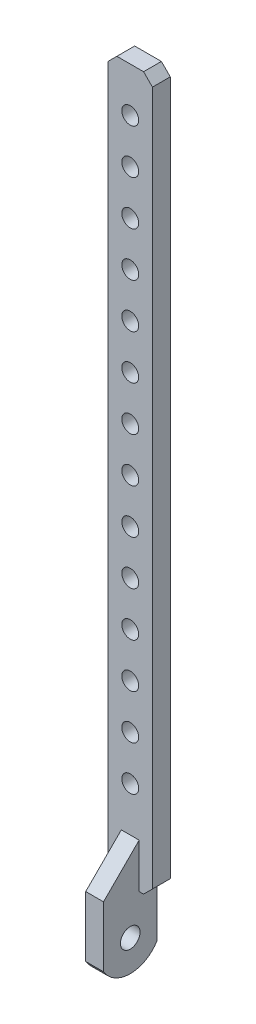
ISO-10303-21;
HEADER;
FILE_DESCRIPTION(('STEP AP214'),'2;1');
FILE_NAME('part.step','',(''),(''),'','','');
FILE_SCHEMA(('AUTOMOTIVE_DESIGN { 1 0 10303 214 1 1 1 1 }'));
ENDSEC;
DATA;
#1=APPLICATION_CONTEXT('core data for automotive mechanical design processes');
#2=APPLICATION_PROTOCOL_DEFINITION('international standard','automotive_design',2000,#1);
#3=PRODUCT_CONTEXT('',#1,'mechanical');
#4=PRODUCT('Part','Part','',(#3));
#5=PRODUCT_RELATED_PRODUCT_CATEGORY('part','',(#4));
#6=PRODUCT_DEFINITION_FORMATION('','',#4);
#7=PRODUCT_DEFINITION_CONTEXT('part definition',#1,'design');
#8=PRODUCT_DEFINITION('design','',#6,#7);
#9=PRODUCT_DEFINITION_SHAPE('','',#8);
#10=(LENGTH_UNIT() NAMED_UNIT(*) SI_UNIT(.MILLI.,.METRE.));
#11=(NAMED_UNIT(*) PLANE_ANGLE_UNIT() SI_UNIT($,.RADIAN.));
#12=(NAMED_UNIT(*) SI_UNIT($,.STERADIAN.) SOLID_ANGLE_UNIT());
#13=UNCERTAINTY_MEASURE_WITH_UNIT(LENGTH_MEASURE(1.E-05),#10,'distance_accuracy_value','');
#14=(GEOMETRIC_REPRESENTATION_CONTEXT(3) GLOBAL_UNCERTAINTY_ASSIGNED_CONTEXT((#13)) GLOBAL_UNIT_ASSIGNED_CONTEXT((#10,
#11,#12)) REPRESENTATION_CONTEXT('',''));
#15=CARTESIAN_POINT('',(0.,0.,0.));
#16=DIRECTION('',(0.,0.,1.));
#17=DIRECTION('',(1.,0.,0.));
#18=AXIS2_PLACEMENT_3D('',#15,#16,#17);
#19=CARTESIAN_POINT('',(-2.5,-40.,2.));
#20=DIRECTION('',(0.,1.,0.));
#21=DIRECTION('',(0.,0.,1.));
#22=AXIS2_PLACEMENT_3D('',#19,#20,#21);
#23=PLANE('',#22);
#24=DIRECTION('',(1.,0.,0.));
#25=VECTOR('',#24,1.);
#26=CARTESIAN_POINT('',(-2.5,-40.,2.));
#27=LINE('',#26,#25);
#28=CARTESIAN_POINT('',(-1.50000000000001,-40.,2.));
#29=VERTEX_POINT('',#28);
#30=CARTESIAN_POINT('',(-1.,-40.,2.));
#31=VERTEX_POINT('',#30);
#32=EDGE_CURVE('E211',#29,#31,#27,.T.);
#33=ORIENTED_EDGE('',*,*,#32,.F.);
#34=DIRECTION('',(0.,0.,-1.));
#35=VECTOR('',#34,1.);
#36=CARTESIAN_POINT('',(-1.50000000000001,-40.,2.));
#37=LINE('',#36,#35);
#38=CARTESIAN_POINT('',(-1.50000000000002,-40.,0.));
#39=VERTEX_POINT('',#38);
#40=EDGE_CURVE('E40',#29,#39,#37,.T.);
#41=ORIENTED_EDGE('',*,*,#40,.T.);
#42=DIRECTION('',(1.,0.,0.));
#43=VECTOR('',#42,1.);
#44=CARTESIAN_POINT('',(-2.5,-40.,0.));
#45=LINE('',#44,#43);
#46=CARTESIAN_POINT('',(-1.,-40.,0.));
#47=VERTEX_POINT('',#46);
#48=EDGE_CURVE('E198',#39,#47,#45,.T.);
#49=ORIENTED_EDGE('',*,*,#48,.T.);
#50=DIRECTION('',(0.,0.,-1.));
#51=VECTOR('',#50,1.);
#52=CARTESIAN_POINT('',(-1.,-40.,6.));
#53=LINE('',#52,#51);
#54=EDGE_CURVE('E170',#31,#47,#53,.T.);
#55=ORIENTED_EDGE('',*,*,#54,.F.);
#56=EDGE_LOOP('',(#33,#41,#49,#55));
#57=FACE_BOUND('',#56,.T.);
#58=ADVANCED_FACE('F32',(#57),#23,.F.);
#59=CARTESIAN_POINT('',(2.5,-40.,2.));
#60=DIRECTION('',(-1.,0.,0.));
#61=DIRECTION('',(0.,0.,1.));
#62=AXIS2_PLACEMENT_3D('',#59,#60,#61);
#63=PLANE('',#62);
#64=DIRECTION('',(0.,1.,0.));
#65=VECTOR('',#64,1.);
#66=CARTESIAN_POINT('',(2.5,-40.,0.));
#67=LINE('',#66,#65);
#68=CARTESIAN_POINT('',(2.5,-39.,0.));
#69=VERTEX_POINT('',#68);
#70=CARTESIAN_POINT('',(2.5,39.,0.));
#71=VERTEX_POINT('',#70);
#72=EDGE_CURVE('E298',#69,#71,#67,.T.);
#73=ORIENTED_EDGE('',*,*,#72,.T.);
#74=DIRECTION('',(0.,0.,1.));
#75=VECTOR('',#74,1.);
#76=CARTESIAN_POINT('',(2.5,39.,2.));
#77=LINE('',#76,#75);
#78=CARTESIAN_POINT('',(2.50000000000001,39.,2.));
#79=VERTEX_POINT('',#78);
#80=EDGE_CURVE('E55',#71,#79,#77,.T.);
#81=ORIENTED_EDGE('',*,*,#80,.T.);
#82=DIRECTION('',(0.,1.,0.));
#83=VECTOR('',#82,1.);
#84=CARTESIAN_POINT('',(2.5,-40.,2.));
#85=LINE('',#84,#83);
#86=CARTESIAN_POINT('',(2.5,-39.,2.));
#87=VERTEX_POINT('',#86);
#88=EDGE_CURVE('E201',#87,#79,#85,.T.);
#89=ORIENTED_EDGE('',*,*,#88,.F.);
#90=DIRECTION('',(0.,0.,-1.));
#91=VECTOR('',#90,1.);
#92=CARTESIAN_POINT('',(2.5,-39.,2.));
#93=LINE('',#92,#91);
#94=EDGE_CURVE('E336',#87,#69,#93,.T.);
#95=ORIENTED_EDGE('',*,*,#94,.T.);
#96=EDGE_LOOP('',(#73,#81,#89,#95));
#97=FACE_BOUND('',#96,.T.);
#98=ADVANCED_FACE('F361',(#97),#63,.F.);
#99=CARTESIAN_POINT('',(-2.5,40.,2.));
#100=DIRECTION('',(0.,-1.,0.));
#101=DIRECTION('',(0.,0.,-1.));
#102=AXIS2_PLACEMENT_3D('',#99,#100,#101);
#103=PLANE('',#102);
#104=DIRECTION('',(-1.,0.,0.));
#105=VECTOR('',#104,1.);
#106=CARTESIAN_POINT('',(-2.5,40.,0.));
#107=LINE('',#106,#105);
#108=CARTESIAN_POINT('',(1.50000000000002,40.,0.));
#109=VERTEX_POINT('',#108);
#110=CARTESIAN_POINT('',(-1.49999999999998,40.,0.));
#111=VERTEX_POINT('',#110);
#112=EDGE_CURVE('E309',#109,#111,#107,.T.);
#113=ORIENTED_EDGE('',*,*,#112,.T.);
#114=DIRECTION('',(0.,0.,1.));
#115=VECTOR('',#114,1.);
#116=CARTESIAN_POINT('',(-1.49999999999998,40.,2.));
#117=LINE('',#116,#115);
#118=CARTESIAN_POINT('',(-1.49999999999998,40.,2.));
#119=VERTEX_POINT('',#118);
#120=EDGE_CURVE('E331',#111,#119,#117,.T.);
#121=ORIENTED_EDGE('',*,*,#120,.T.);
#122=DIRECTION('',(-1.,0.,0.));
#123=VECTOR('',#122,1.);
#124=CARTESIAN_POINT('',(-2.5,40.,2.));
#125=LINE('',#124,#123);
#126=CARTESIAN_POINT('',(1.50000000000001,40.,2.));
#127=VERTEX_POINT('',#126);
#128=EDGE_CURVE('E302',#127,#119,#125,.T.);
#129=ORIENTED_EDGE('',*,*,#128,.F.);
#130=DIRECTION('',(0.,0.,-1.));
#131=VECTOR('',#130,1.);
#132=CARTESIAN_POINT('',(1.50000000000001,40.,2.));
#133=LINE('',#132,#131);
#134=EDGE_CURVE('E367',#127,#109,#133,.T.);
#135=ORIENTED_EDGE('',*,*,#134,.T.);
#136=EDGE_LOOP('',(#113,#121,#129,#135));
#137=FACE_BOUND('',#136,.T.);
#138=ADVANCED_FACE('F371',(#137),#103,.F.);
#139=CARTESIAN_POINT('',(-2.5,-40.,2.));
#140=DIRECTION('',(1.,0.,0.));
#141=DIRECTION('',(0.,0.,-1.));
#142=AXIS2_PLACEMENT_3D('',#139,#140,#141);
#143=PLANE('',#142);
#144=DIRECTION('',(0.,-1.,0.));
#145=VECTOR('',#144,1.);
#146=CARTESIAN_POINT('',(-2.5,-40.,2.));
#147=LINE('',#146,#145);
#148=CARTESIAN_POINT('',(-2.50000000000001,39.,2.));
#149=VERTEX_POINT('',#148);
#150=CARTESIAN_POINT('',(-2.5,-39.,2.));
#151=VERTEX_POINT('',#150);
#152=EDGE_CURVE('E305',#149,#151,#147,.T.);
#153=ORIENTED_EDGE('',*,*,#152,.F.);
#154=DIRECTION('',(0.,0.,-1.));
#155=VECTOR('',#154,1.);
#156=CARTESIAN_POINT('',(-2.5,39.,2.));
#157=LINE('',#156,#155);
#158=CARTESIAN_POINT('',(-2.5,39.,0.));
#159=VERTEX_POINT('',#158);
#160=EDGE_CURVE('E194',#149,#159,#157,.T.);
#161=ORIENTED_EDGE('',*,*,#160,.T.);
#162=DIRECTION('',(0.,-1.,0.));
#163=VECTOR('',#162,1.);
#164=CARTESIAN_POINT('',(-2.5,-40.,0.));
#165=LINE('',#164,#163);
#166=CARTESIAN_POINT('',(-2.5,-39.,0.));
#167=VERTEX_POINT('',#166);
#168=EDGE_CURVE('E206',#159,#167,#165,.T.);
#169=ORIENTED_EDGE('',*,*,#168,.T.);
#170=DIRECTION('',(0.,0.,1.));
#171=VECTOR('',#170,1.);
#172=CARTESIAN_POINT('',(-2.5,-39.,2.));
#173=LINE('',#172,#171);
#174=EDGE_CURVE('E192',#167,#151,#173,.T.);
#175=ORIENTED_EDGE('',*,*,#174,.T.);
#176=EDGE_LOOP('',(#153,#161,#169,#175));
#177=FACE_BOUND('',#176,.T.);
#178=ADVANCED_FACE('F319',(#177),#143,.F.);
#179=CARTESIAN_POINT('',(1.,-40.,0.));
#180=VERTEX_POINT('',#179);
#181=CARTESIAN_POINT('',(1.49999999999999,-40.,0.));
#182=VERTEX_POINT('',#181);
#183=EDGE_CURVE('E163',#180,#182,#45,.T.);
#184=ORIENTED_EDGE('',*,*,#183,.T.);
#185=DIRECTION('',(0.,0.,1.));
#186=VECTOR('',#185,1.);
#187=CARTESIAN_POINT('',(1.49999999999999,-40.,2.));
#188=LINE('',#187,#186);
#189=CARTESIAN_POINT('',(1.49999999999998,-40.,2.));
#190=VERTEX_POINT('',#189);
#191=EDGE_CURVE('E11',#182,#190,#188,.T.);
#192=ORIENTED_EDGE('',*,*,#191,.T.);
#193=CARTESIAN_POINT('',(1.,-40.,2.));
#194=VERTEX_POINT('',#193);
#195=EDGE_CURVE('E307',#194,#190,#27,.T.);
#196=ORIENTED_EDGE('',*,*,#195,.F.);
#197=DIRECTION('',(0.,0.,-1.));
#198=VECTOR('',#197,1.);
#199=CARTESIAN_POINT('',(1.,-40.,6.));
#200=LINE('',#199,#198);
#201=EDGE_CURVE('E209',#194,#180,#200,.T.);
#202=ORIENTED_EDGE('',*,*,#201,.T.);
#203=EDGE_LOOP('',(#184,#192,#196,#202));
#204=FACE_BOUND('',#203,.T.);
#205=ADVANCED_FACE('F388',(#204),#23,.F.);
#206=CARTESIAN_POINT('',(0.,0.,2.));
#207=DIRECTION('',(0.,0.,-1.));
#208=DIRECTION('',(-1.,0.,0.));
#209=AXIS2_PLACEMENT_3D('',#206,#207,#208);
#210=PLANE('',#209);
#211=CARTESIAN_POINT('',(0.,-30.,2.));
#212=DIRECTION('',(0.,0.,1.));
#213=DIRECTION('',(1.,0.,0.));
#214=AXIS2_PLACEMENT_3D('',#211,#212,#213);
#215=CIRCLE('',#214,0.95);
#216=CARTESIAN_POINT('',(0.95,-30.,2.));
#217=VERTEX_POINT('',#216);
#218=EDGE_CURVE('E220',#217,#217,#215,.T.);
#219=ORIENTED_EDGE('',*,*,#218,.F.);
#220=EDGE_LOOP('',(#219));
#221=FACE_BOUND('',#220,.T.);
#222=CARTESIAN_POINT('',(0.,-25.,2.));
#223=DIRECTION('',(0.,0.,1.));
#224=DIRECTION('',(1.,0.,0.));
#225=AXIS2_PLACEMENT_3D('',#222,#223,#224);
#226=CIRCLE('',#225,0.95);
#227=CARTESIAN_POINT('',(0.95,-25.,2.));
#228=VERTEX_POINT('',#227);
#229=EDGE_CURVE('E219',#228,#228,#226,.T.);
#230=ORIENTED_EDGE('',*,*,#229,.F.);
#231=EDGE_LOOP('',(#230));
#232=FACE_BOUND('',#231,.T.);
#233=CARTESIAN_POINT('',(0.,-20.,2.));
#234=DIRECTION('',(0.,0.,1.));
#235=DIRECTION('',(1.,0.,0.));
#236=AXIS2_PLACEMENT_3D('',#233,#234,#235);
#237=CIRCLE('',#236,0.95);
#238=CARTESIAN_POINT('',(0.950000000000006,-20.,2.));
#239=VERTEX_POINT('',#238);
#240=EDGE_CURVE('E226',#239,#239,#237,.T.);
#241=ORIENTED_EDGE('',*,*,#240,.F.);
#242=EDGE_LOOP('',(#241));
#243=FACE_BOUND('',#242,.T.);
#244=CARTESIAN_POINT('',(0.,-15.,2.));
#245=DIRECTION('',(0.,0.,1.));
#246=DIRECTION('',(1.,0.,0.));
#247=AXIS2_PLACEMENT_3D('',#244,#245,#246);
#248=CIRCLE('',#247,0.95);
#249=CARTESIAN_POINT('',(0.950000000000006,-15.,2.));
#250=VERTEX_POINT('',#249);
#251=EDGE_CURVE('E232',#250,#250,#248,.T.);
#252=ORIENTED_EDGE('',*,*,#251,.F.);
#253=EDGE_LOOP('',(#252));
#254=FACE_BOUND('',#253,.T.);
#255=CARTESIAN_POINT('',(0.,-9.99999999999999,2.));
#256=DIRECTION('',(0.,0.,1.));
#257=DIRECTION('',(1.,0.,0.));
#258=AXIS2_PLACEMENT_3D('',#255,#256,#257);
#259=CIRCLE('',#258,0.95);
#260=CARTESIAN_POINT('',(0.950000000000005,-9.99999999999999,2.));
#261=VERTEX_POINT('',#260);
#262=EDGE_CURVE('E238',#261,#261,#259,.T.);
#263=ORIENTED_EDGE('',*,*,#262,.F.);
#264=EDGE_LOOP('',(#263));
#265=FACE_BOUND('',#264,.T.);
#266=CARTESIAN_POINT('',(0.,-5.,2.));
#267=DIRECTION('',(0.,0.,1.));
#268=DIRECTION('',(1.,0.,0.));
#269=AXIS2_PLACEMENT_3D('',#266,#267,#268);
#270=CIRCLE('',#269,0.95);
#271=CARTESIAN_POINT('',(0.950000000000005,-5.,2.));
#272=VERTEX_POINT('',#271);
#273=EDGE_CURVE('E244',#272,#272,#270,.T.);
#274=ORIENTED_EDGE('',*,*,#273,.F.);
#275=EDGE_LOOP('',(#274));
#276=FACE_BOUND('',#275,.T.);
#277=CARTESIAN_POINT('',(0.,5.,2.));
#278=DIRECTION('',(0.,0.,1.));
#279=DIRECTION('',(1.,0.,0.));
#280=AXIS2_PLACEMENT_3D('',#277,#278,#279);
#281=CIRCLE('',#280,0.95);
#282=CARTESIAN_POINT('',(0.950000000000004,5.,2.));
#283=VERTEX_POINT('',#282);
#284=EDGE_CURVE('E250',#283,#283,#281,.T.);
#285=ORIENTED_EDGE('',*,*,#284,.F.);
#286=EDGE_LOOP('',(#285));
#287=FACE_BOUND('',#286,.T.);
#288=CARTESIAN_POINT('',(0.,10.,2.));
#289=DIRECTION('',(0.,0.,1.));
#290=DIRECTION('',(1.,0.,0.));
#291=AXIS2_PLACEMENT_3D('',#288,#289,#290);
#292=CIRCLE('',#291,0.95);
#293=CARTESIAN_POINT('',(0.950000000000003,10.,2.));
#294=VERTEX_POINT('',#293);
#295=EDGE_CURVE('E256',#294,#294,#292,.T.);
#296=ORIENTED_EDGE('',*,*,#295,.F.);
#297=EDGE_LOOP('',(#296));
#298=FACE_BOUND('',#297,.T.);
#299=CARTESIAN_POINT('',(0.,15.,2.));
#300=DIRECTION('',(0.,0.,1.));
#301=DIRECTION('',(1.,0.,0.));
#302=AXIS2_PLACEMENT_3D('',#299,#300,#301);
#303=CIRCLE('',#302,0.95);
#304=CARTESIAN_POINT('',(0.950000000000002,15.,2.));
#305=VERTEX_POINT('',#304);
#306=EDGE_CURVE('E262',#305,#305,#303,.T.);
#307=ORIENTED_EDGE('',*,*,#306,.F.);
#308=EDGE_LOOP('',(#307));
#309=FACE_BOUND('',#308,.T.);
#310=CARTESIAN_POINT('',(0.,20.,2.));
#311=DIRECTION('',(0.,0.,1.));
#312=DIRECTION('',(1.,0.,0.));
#313=AXIS2_PLACEMENT_3D('',#310,#311,#312);
#314=CIRCLE('',#313,0.95);
#315=CARTESIAN_POINT('',(0.950000000000001,20.,2.));
#316=VERTEX_POINT('',#315);
#317=EDGE_CURVE('E268',#316,#316,#314,.T.);
#318=ORIENTED_EDGE('',*,*,#317,.F.);
#319=EDGE_LOOP('',(#318));
#320=FACE_BOUND('',#319,.T.);
#321=CARTESIAN_POINT('',(0.,25.,2.));
#322=DIRECTION('',(0.,0.,1.));
#323=DIRECTION('',(1.,0.,0.));
#324=AXIS2_PLACEMENT_3D('',#321,#322,#323);
#325=CIRCLE('',#324,0.95);
#326=CARTESIAN_POINT('',(0.950000000000001,25.,2.));
#327=VERTEX_POINT('',#326);
#328=EDGE_CURVE('E274',#327,#327,#325,.T.);
#329=ORIENTED_EDGE('',*,*,#328,.F.);
#330=EDGE_LOOP('',(#329));
#331=FACE_BOUND('',#330,.T.);
#332=CARTESIAN_POINT('',(0.,30.,2.));
#333=DIRECTION('',(0.,0.,1.));
#334=DIRECTION('',(1.,0.,0.));
#335=AXIS2_PLACEMENT_3D('',#332,#333,#334);
#336=CIRCLE('',#335,0.95);
#337=CARTESIAN_POINT('',(0.95,30.,2.));
#338=VERTEX_POINT('',#337);
#339=EDGE_CURVE('E280',#338,#338,#336,.T.);
#340=ORIENTED_EDGE('',*,*,#339,.F.);
#341=EDGE_LOOP('',(#340));
#342=FACE_BOUND('',#341,.T.);
#343=CARTESIAN_POINT('',(0.,0.,2.));
#344=DIRECTION('',(0.,0.,1.));
#345=DIRECTION('',(1.,0.,0.));
#346=AXIS2_PLACEMENT_3D('',#343,#344,#345);
#347=CIRCLE('',#346,0.95);
#348=CARTESIAN_POINT('',(0.950000000000004,0.,2.));
#349=VERTEX_POINT('',#348);
#350=EDGE_CURVE('E286',#349,#349,#347,.T.);
#351=ORIENTED_EDGE('',*,*,#350,.F.);
#352=EDGE_LOOP('',(#351));
#353=FACE_BOUND('',#352,.T.);
#354=CARTESIAN_POINT('',(0.,35.,2.));
#355=DIRECTION('',(0.,0.,1.));
#356=DIRECTION('',(1.,0.,0.));
#357=AXIS2_PLACEMENT_3D('',#354,#355,#356);
#358=CIRCLE('',#357,0.95);
#359=CARTESIAN_POINT('',(0.95,35.,2.));
#360=VERTEX_POINT('',#359);
#361=EDGE_CURVE('E292',#360,#360,#358,.T.);
#362=ORIENTED_EDGE('',*,*,#361,.F.);
#363=EDGE_LOOP('',(#362));
#364=FACE_BOUND('',#363,.T.);
#365=ORIENTED_EDGE('',*,*,#128,.T.);
#366=DIRECTION('',(0.707106781186548,0.707106781186548,0.));
#367=VECTOR('',#366,1.);
#368=CARTESIAN_POINT('',(-2.5,39.,2.));
#369=LINE('',#368,#367);
#370=EDGE_CURVE('E329',#119,#149,#369,.F.);
#371=ORIENTED_EDGE('',*,*,#370,.T.);
#372=ORIENTED_EDGE('',*,*,#152,.T.);
#373=DIRECTION('',(-0.707106781186545,0.70710678118655,0.));
#374=VECTOR('',#373,1.);
#375=CARTESIAN_POINT('',(-1.50000000000001,-40.,2.));
#376=LINE('',#375,#374);
#377=EDGE_CURVE('E47',#151,#29,#376,.F.);
#378=ORIENTED_EDGE('',*,*,#377,.T.);
#379=ORIENTED_EDGE('',*,*,#32,.T.);
#380=DIRECTION('',(0.,1.,0.));
#381=VECTOR('',#380,1.);
#382=CARTESIAN_POINT('',(-1.,0.,2.));
#383=LINE('',#382,#381);
#384=CARTESIAN_POINT('',(-1.,-34.9999999999999,2.));
#385=VERTEX_POINT('',#384);
#386=EDGE_CURVE('E177',#31,#385,#383,.T.);
#387=ORIENTED_EDGE('',*,*,#386,.T.);
#388=DIRECTION('',(1.,0.,0.));
#389=VECTOR('',#388,1.);
#390=CARTESIAN_POINT('',(0.,-34.9999999999999,2.));
#391=LINE('',#390,#389);
#392=CARTESIAN_POINT('',(1.,-34.9999999999999,2.));
#393=VERTEX_POINT('',#392);
#394=EDGE_CURVE('E180',#385,#393,#391,.T.);
#395=ORIENTED_EDGE('',*,*,#394,.T.);
#396=DIRECTION('',(0.,-1.,0.));
#397=VECTOR('',#396,1.);
#398=CARTESIAN_POINT('',(1.,0.,2.));
#399=LINE('',#398,#397);
#400=EDGE_CURVE('E183',#393,#194,#399,.T.);
#401=ORIENTED_EDGE('',*,*,#400,.T.);
#402=ORIENTED_EDGE('',*,*,#195,.T.);
#403=DIRECTION('',(-0.70710678118655,-0.707106781186545,0.));
#404=VECTOR('',#403,1.);
#405=CARTESIAN_POINT('',(2.5,-39.,2.));
#406=LINE('',#405,#404);
#407=EDGE_CURVE('E327',#190,#87,#406,.F.);
#408=ORIENTED_EDGE('',*,*,#407,.T.);
#409=ORIENTED_EDGE('',*,*,#88,.T.);
#410=DIRECTION('',(0.707106781186548,-0.707106781186548,0.));
#411=VECTOR('',#410,1.);
#412=CARTESIAN_POINT('',(1.50000000000001,40.,2.));
#413=LINE('',#412,#411);
#414=EDGE_CURVE('E326',#79,#127,#413,.F.);
#415=ORIENTED_EDGE('',*,*,#414,.T.);
#416=EDGE_LOOP('',(#365,#371,#372,#378,#379,#387,#395,#401,#402,#408,#409,#415));
#417=FACE_BOUND('',#416,.T.);
#418=ADVANCED_FACE('F348',(#221,#232,#243,#254,#265,#276,#287,#298,#309,#320,#331,#342,#353,
#364,#417),#210,.F.);
#419=CARTESIAN_POINT('',(0.,0.,0.));
#420=DIRECTION('',(0.,0.,-1.));
#421=DIRECTION('',(-1.,0.,0.));
#422=AXIS2_PLACEMENT_3D('',#419,#420,#421);
#423=PLANE('',#422);
#424=ORIENTED_EDGE('',*,*,#168,.F.);
#425=DIRECTION('',(-0.707106781186548,-0.707106781186548,0.));
#426=VECTOR('',#425,1.);
#427=CARTESIAN_POINT('',(-20.75,20.75,0.));
#428=LINE('',#427,#426);
#429=EDGE_CURVE('E365',#159,#111,#428,.F.);
#430=ORIENTED_EDGE('',*,*,#429,.T.);
#431=ORIENTED_EDGE('',*,*,#112,.F.);
#432=DIRECTION('',(-0.707106781186548,0.707106781186548,0.));
#433=VECTOR('',#432,1.);
#434=CARTESIAN_POINT('',(20.75,20.75,0.));
#435=LINE('',#434,#433);
#436=EDGE_CURVE('E362',#109,#71,#435,.F.);
#437=ORIENTED_EDGE('',*,*,#436,.T.);
#438=ORIENTED_EDGE('',*,*,#72,.F.);
#439=DIRECTION('',(0.70710678118655,0.707106781186545,0.));
#440=VECTOR('',#439,1.);
#441=CARTESIAN_POINT('',(20.75,-20.7500000000001,0.));
#442=LINE('',#441,#440);
#443=EDGE_CURVE('E197',#69,#182,#442,.F.);
#444=ORIENTED_EDGE('',*,*,#443,.T.);
#445=ORIENTED_EDGE('',*,*,#183,.F.);
#446=DIRECTION('',(0.,-1.,0.));
#447=VECTOR('',#446,1.);
#448=CARTESIAN_POINT('',(1.,-48.,0.));
#449=LINE('',#448,#447);
#450=CARTESIAN_POINT('',(1.,-45.802775637732,0.));
#451=VERTEX_POINT('',#450);
#452=EDGE_CURVE('E152',#180,#451,#449,.T.);
#453=ORIENTED_EDGE('',*,*,#452,.T.);
#454=DIRECTION('',(-1.,0.,0.));
#455=VECTOR('',#454,1.);
#456=CARTESIAN_POINT('',(2.501025,-45.802775637732,0.));
#457=LINE('',#456,#455);
#458=CARTESIAN_POINT('',(-1.,-45.802775637732,0.));
#459=VERTEX_POINT('',#458);
#460=EDGE_CURVE('E134',#451,#459,#457,.T.);
#461=ORIENTED_EDGE('',*,*,#460,.T.);
#462=DIRECTION('',(0.,1.,0.));
#463=VECTOR('',#462,1.);
#464=CARTESIAN_POINT('',(-1.,-48.,0.));
#465=LINE('',#464,#463);
#466=EDGE_CURVE('E145',#459,#47,#465,.T.);
#467=ORIENTED_EDGE('',*,*,#466,.T.);
#468=ORIENTED_EDGE('',*,*,#48,.F.);
#469=DIRECTION('',(0.707106781186545,-0.70710678118655,0.));
#470=VECTOR('',#469,1.);
#471=CARTESIAN_POINT('',(-20.75,-20.7499999999999,0.));
#472=LINE('',#471,#470);
#473=EDGE_CURVE('E324',#39,#167,#472,.F.);
#474=ORIENTED_EDGE('',*,*,#473,.T.);
#475=EDGE_LOOP('',(#424,#430,#431,#437,#438,#444,#445,#453,#461,#467,#468,#474));
#476=FACE_BOUND('',#475,.T.);
#477=CARTESIAN_POINT('',(0.,-30.,0.));
#478=DIRECTION('',(0.,0.,1.));
#479=DIRECTION('',(1.,0.,0.));
#480=AXIS2_PLACEMENT_3D('',#477,#478,#479);
#481=CIRCLE('',#480,0.95);
#482=CARTESIAN_POINT('',(0.95,-30.,0.));
#483=VERTEX_POINT('',#482);
#484=EDGE_CURVE('E216',#483,#483,#481,.T.);
#485=ORIENTED_EDGE('',*,*,#484,.T.);
#486=EDGE_LOOP('',(#485));
#487=FACE_BOUND('',#486,.T.);
#488=CARTESIAN_POINT('',(0.,-25.,0.));
#489=DIRECTION('',(0.,0.,1.));
#490=DIRECTION('',(1.,0.,0.));
#491=AXIS2_PLACEMENT_3D('',#488,#489,#490);
#492=CIRCLE('',#491,0.95);
#493=CARTESIAN_POINT('',(0.95,-25.,0.));
#494=VERTEX_POINT('',#493);
#495=EDGE_CURVE('E223',#494,#494,#492,.T.);
#496=ORIENTED_EDGE('',*,*,#495,.T.);
#497=EDGE_LOOP('',(#496));
#498=FACE_BOUND('',#497,.T.);
#499=CARTESIAN_POINT('',(0.,-20.,0.));
#500=DIRECTION('',(0.,0.,1.));
#501=DIRECTION('',(1.,0.,0.));
#502=AXIS2_PLACEMENT_3D('',#499,#500,#501);
#503=CIRCLE('',#502,0.95);
#504=CARTESIAN_POINT('',(0.950000000000006,-20.,0.));
#505=VERTEX_POINT('',#504);
#506=EDGE_CURVE('E229',#505,#505,#503,.T.);
#507=ORIENTED_EDGE('',*,*,#506,.T.);
#508=EDGE_LOOP('',(#507));
#509=FACE_BOUND('',#508,.T.);
#510=CARTESIAN_POINT('',(0.,-15.,0.));
#511=DIRECTION('',(0.,0.,1.));
#512=DIRECTION('',(1.,0.,0.));
#513=AXIS2_PLACEMENT_3D('',#510,#511,#512);
#514=CIRCLE('',#513,0.95);
#515=CARTESIAN_POINT('',(0.950000000000006,-15.,0.));
#516=VERTEX_POINT('',#515);
#517=EDGE_CURVE('E235',#516,#516,#514,.T.);
#518=ORIENTED_EDGE('',*,*,#517,.T.);
#519=EDGE_LOOP('',(#518));
#520=FACE_BOUND('',#519,.T.);
#521=CARTESIAN_POINT('',(0.,-9.99999999999999,0.));
#522=DIRECTION('',(0.,0.,1.));
#523=DIRECTION('',(1.,0.,0.));
#524=AXIS2_PLACEMENT_3D('',#521,#522,#523);
#525=CIRCLE('',#524,0.95);
#526=CARTESIAN_POINT('',(0.950000000000005,-9.99999999999999,0.));
#527=VERTEX_POINT('',#526);
#528=EDGE_CURVE('E241',#527,#527,#525,.T.);
#529=ORIENTED_EDGE('',*,*,#528,.T.);
#530=EDGE_LOOP('',(#529));
#531=FACE_BOUND('',#530,.T.);
#532=CARTESIAN_POINT('',(0.,-5.,0.));
#533=DIRECTION('',(0.,0.,1.));
#534=DIRECTION('',(1.,0.,0.));
#535=AXIS2_PLACEMENT_3D('',#532,#533,#534);
#536=CIRCLE('',#535,0.95);
#537=CARTESIAN_POINT('',(0.950000000000005,-5.,0.));
#538=VERTEX_POINT('',#537);
#539=EDGE_CURVE('E247',#538,#538,#536,.T.);
#540=ORIENTED_EDGE('',*,*,#539,.T.);
#541=EDGE_LOOP('',(#540));
#542=FACE_BOUND('',#541,.T.);
#543=CARTESIAN_POINT('',(0.,5.,0.));
#544=DIRECTION('',(0.,0.,1.));
#545=DIRECTION('',(1.,0.,0.));
#546=AXIS2_PLACEMENT_3D('',#543,#544,#545);
#547=CIRCLE('',#546,0.95);
#548=CARTESIAN_POINT('',(0.950000000000004,5.,0.));
#549=VERTEX_POINT('',#548);
#550=EDGE_CURVE('E253',#549,#549,#547,.T.);
#551=ORIENTED_EDGE('',*,*,#550,.T.);
#552=EDGE_LOOP('',(#551));
#553=FACE_BOUND('',#552,.T.);
#554=CARTESIAN_POINT('',(0.,10.,0.));
#555=DIRECTION('',(0.,0.,1.));
#556=DIRECTION('',(1.,0.,0.));
#557=AXIS2_PLACEMENT_3D('',#554,#555,#556);
#558=CIRCLE('',#557,0.95);
#559=CARTESIAN_POINT('',(0.950000000000003,10.,0.));
#560=VERTEX_POINT('',#559);
#561=EDGE_CURVE('E259',#560,#560,#558,.T.);
#562=ORIENTED_EDGE('',*,*,#561,.T.);
#563=EDGE_LOOP('',(#562));
#564=FACE_BOUND('',#563,.T.);
#565=CARTESIAN_POINT('',(0.,15.,0.));
#566=DIRECTION('',(0.,0.,1.));
#567=DIRECTION('',(1.,0.,0.));
#568=AXIS2_PLACEMENT_3D('',#565,#566,#567);
#569=CIRCLE('',#568,0.95);
#570=CARTESIAN_POINT('',(0.950000000000002,15.,0.));
#571=VERTEX_POINT('',#570);
#572=EDGE_CURVE('E265',#571,#571,#569,.T.);
#573=ORIENTED_EDGE('',*,*,#572,.T.);
#574=EDGE_LOOP('',(#573));
#575=FACE_BOUND('',#574,.T.);
#576=CARTESIAN_POINT('',(0.,20.,0.));
#577=DIRECTION('',(0.,0.,1.));
#578=DIRECTION('',(1.,0.,0.));
#579=AXIS2_PLACEMENT_3D('',#576,#577,#578);
#580=CIRCLE('',#579,0.95);
#581=CARTESIAN_POINT('',(0.950000000000001,20.,0.));
#582=VERTEX_POINT('',#581);
#583=EDGE_CURVE('E271',#582,#582,#580,.T.);
#584=ORIENTED_EDGE('',*,*,#583,.T.);
#585=EDGE_LOOP('',(#584));
#586=FACE_BOUND('',#585,.T.);
#587=CARTESIAN_POINT('',(0.,25.,0.));
#588=DIRECTION('',(0.,0.,1.));
#589=DIRECTION('',(1.,0.,0.));
#590=AXIS2_PLACEMENT_3D('',#587,#588,#589);
#591=CIRCLE('',#590,0.95);
#592=CARTESIAN_POINT('',(0.950000000000001,25.,0.));
#593=VERTEX_POINT('',#592);
#594=EDGE_CURVE('E277',#593,#593,#591,.T.);
#595=ORIENTED_EDGE('',*,*,#594,.T.);
#596=EDGE_LOOP('',(#595));
#597=FACE_BOUND('',#596,.T.);
#598=CARTESIAN_POINT('',(0.,30.,0.));
#599=DIRECTION('',(0.,0.,1.));
#600=DIRECTION('',(1.,0.,0.));
#601=AXIS2_PLACEMENT_3D('',#598,#599,#600);
#602=CIRCLE('',#601,0.95);
#603=CARTESIAN_POINT('',(0.95,30.,0.));
#604=VERTEX_POINT('',#603);
#605=EDGE_CURVE('E283',#604,#604,#602,.T.);
#606=ORIENTED_EDGE('',*,*,#605,.T.);
#607=EDGE_LOOP('',(#606));
#608=FACE_BOUND('',#607,.T.);
#609=CARTESIAN_POINT('',(0.,0.,0.));
#610=DIRECTION('',(0.,0.,1.));
#611=DIRECTION('',(1.,0.,0.));
#612=AXIS2_PLACEMENT_3D('',#609,#610,#611);
#613=CIRCLE('',#612,0.95);
#614=CARTESIAN_POINT('',(0.950000000000004,0.,0.));
#615=VERTEX_POINT('',#614);
#616=EDGE_CURVE('E289',#615,#615,#613,.T.);
#617=ORIENTED_EDGE('',*,*,#616,.T.);
#618=EDGE_LOOP('',(#617));
#619=FACE_BOUND('',#618,.T.);
#620=CARTESIAN_POINT('',(0.,35.,0.));
#621=DIRECTION('',(0.,0.,1.));
#622=DIRECTION('',(1.,0.,0.));
#623=AXIS2_PLACEMENT_3D('',#620,#621,#622);
#624=CIRCLE('',#623,0.95);
#625=CARTESIAN_POINT('',(0.95,35.,0.));
#626=VERTEX_POINT('',#625);
#627=EDGE_CURVE('E295',#626,#626,#624,.T.);
#628=ORIENTED_EDGE('',*,*,#627,.T.);
#629=EDGE_LOOP('',(#628));
#630=FACE_BOUND('',#629,.T.);
#631=ADVANCED_FACE('F160',(#476,#487,#498,#509,#520,#531,#542,#553,#564,#575,#586,#597,#608,
#619,#630),#423,.T.);
#632=CARTESIAN_POINT('',(0.,35.,0.));
#633=DIRECTION('',(0.,0.,1.));
#634=DIRECTION('',(1.,0.,0.));
#635=AXIS2_PLACEMENT_3D('',#632,#633,#634);
#636=CYLINDRICAL_SURFACE('',#635,0.95);
#637=ORIENTED_EDGE('',*,*,#627,.F.);
#638=EDGE_LOOP('',(#637));
#639=FACE_BOUND('',#638,.T.);
#640=ORIENTED_EDGE('',*,*,#361,.T.);
#641=EDGE_LOOP('',(#640));
#642=FACE_BOUND('',#641,.T.);
#643=ADVANCED_FACE('F599',(#639,#642),#636,.F.);
#644=CARTESIAN_POINT('',(0.,0.,0.));
#645=DIRECTION('',(0.,0.,1.));
#646=DIRECTION('',(1.,0.,0.));
#647=AXIS2_PLACEMENT_3D('',#644,#645,#646);
#648=CYLINDRICAL_SURFACE('',#647,0.95);
#649=ORIENTED_EDGE('',*,*,#616,.F.);
#650=EDGE_LOOP('',(#649));
#651=FACE_BOUND('',#650,.T.);
#652=ORIENTED_EDGE('',*,*,#350,.T.);
#653=EDGE_LOOP('',(#652));
#654=FACE_BOUND('',#653,.T.);
#655=ADVANCED_FACE('F589',(#651,#654),#648,.F.);
#656=CARTESIAN_POINT('',(0.,30.,0.));
#657=DIRECTION('',(0.,0.,1.));
#658=DIRECTION('',(1.,0.,0.));
#659=AXIS2_PLACEMENT_3D('',#656,#657,#658);
#660=CYLINDRICAL_SURFACE('',#659,0.95);
#661=ORIENTED_EDGE('',*,*,#605,.F.);
#662=EDGE_LOOP('',(#661));
#663=FACE_BOUND('',#662,.T.);
#664=ORIENTED_EDGE('',*,*,#339,.T.);
#665=EDGE_LOOP('',(#664));
#666=FACE_BOUND('',#665,.T.);
#667=ADVANCED_FACE('F579',(#663,#666),#660,.F.);
#668=CARTESIAN_POINT('',(0.,25.,0.));
#669=DIRECTION('',(0.,0.,1.));
#670=DIRECTION('',(1.,0.,0.));
#671=AXIS2_PLACEMENT_3D('',#668,#669,#670);
#672=CYLINDRICAL_SURFACE('',#671,0.95);
#673=ORIENTED_EDGE('',*,*,#594,.F.);
#674=EDGE_LOOP('',(#673));
#675=FACE_BOUND('',#674,.T.);
#676=ORIENTED_EDGE('',*,*,#328,.T.);
#677=EDGE_LOOP('',(#676));
#678=FACE_BOUND('',#677,.T.);
#679=ADVANCED_FACE('F569',(#675,#678),#672,.F.);
#680=CARTESIAN_POINT('',(0.,20.,0.));
#681=DIRECTION('',(0.,0.,1.));
#682=DIRECTION('',(1.,0.,0.));
#683=AXIS2_PLACEMENT_3D('',#680,#681,#682);
#684=CYLINDRICAL_SURFACE('',#683,0.95);
#685=ORIENTED_EDGE('',*,*,#583,.F.);
#686=EDGE_LOOP('',(#685));
#687=FACE_BOUND('',#686,.T.);
#688=ORIENTED_EDGE('',*,*,#317,.T.);
#689=EDGE_LOOP('',(#688));
#690=FACE_BOUND('',#689,.T.);
#691=ADVANCED_FACE('F559',(#687,#690),#684,.F.);
#692=CARTESIAN_POINT('',(0.,15.,0.));
#693=DIRECTION('',(0.,0.,1.));
#694=DIRECTION('',(1.,0.,0.));
#695=AXIS2_PLACEMENT_3D('',#692,#693,#694);
#696=CYLINDRICAL_SURFACE('',#695,0.95);
#697=ORIENTED_EDGE('',*,*,#572,.F.);
#698=EDGE_LOOP('',(#697));
#699=FACE_BOUND('',#698,.T.);
#700=ORIENTED_EDGE('',*,*,#306,.T.);
#701=EDGE_LOOP('',(#700));
#702=FACE_BOUND('',#701,.T.);
#703=ADVANCED_FACE('F549',(#699,#702),#696,.F.);
#704=CARTESIAN_POINT('',(0.,10.,0.));
#705=DIRECTION('',(0.,0.,1.));
#706=DIRECTION('',(1.,0.,0.));
#707=AXIS2_PLACEMENT_3D('',#704,#705,#706);
#708=CYLINDRICAL_SURFACE('',#707,0.95);
#709=ORIENTED_EDGE('',*,*,#561,.F.);
#710=EDGE_LOOP('',(#709));
#711=FACE_BOUND('',#710,.T.);
#712=ORIENTED_EDGE('',*,*,#295,.T.);
#713=EDGE_LOOP('',(#712));
#714=FACE_BOUND('',#713,.T.);
#715=ADVANCED_FACE('F539',(#711,#714),#708,.F.);
#716=CARTESIAN_POINT('',(0.,5.,0.));
#717=DIRECTION('',(0.,0.,1.));
#718=DIRECTION('',(1.,0.,0.));
#719=AXIS2_PLACEMENT_3D('',#716,#717,#718);
#720=CYLINDRICAL_SURFACE('',#719,0.95);
#721=ORIENTED_EDGE('',*,*,#550,.F.);
#722=EDGE_LOOP('',(#721));
#723=FACE_BOUND('',#722,.T.);
#724=ORIENTED_EDGE('',*,*,#284,.T.);
#725=EDGE_LOOP('',(#724));
#726=FACE_BOUND('',#725,.T.);
#727=ADVANCED_FACE('F529',(#723,#726),#720,.F.);
#728=CARTESIAN_POINT('',(0.,-5.,0.));
#729=DIRECTION('',(0.,0.,1.));
#730=DIRECTION('',(1.,0.,0.));
#731=AXIS2_PLACEMENT_3D('',#728,#729,#730);
#732=CYLINDRICAL_SURFACE('',#731,0.95);
#733=ORIENTED_EDGE('',*,*,#539,.F.);
#734=EDGE_LOOP('',(#733));
#735=FACE_BOUND('',#734,.T.);
#736=ORIENTED_EDGE('',*,*,#273,.T.);
#737=EDGE_LOOP('',(#736));
#738=FACE_BOUND('',#737,.T.);
#739=ADVANCED_FACE('F519',(#735,#738),#732,.F.);
#740=CARTESIAN_POINT('',(0.,-9.99999999999999,0.));
#741=DIRECTION('',(0.,0.,1.));
#742=DIRECTION('',(1.,0.,0.));
#743=AXIS2_PLACEMENT_3D('',#740,#741,#742);
#744=CYLINDRICAL_SURFACE('',#743,0.95);
#745=ORIENTED_EDGE('',*,*,#528,.F.);
#746=EDGE_LOOP('',(#745));
#747=FACE_BOUND('',#746,.T.);
#748=ORIENTED_EDGE('',*,*,#262,.T.);
#749=EDGE_LOOP('',(#748));
#750=FACE_BOUND('',#749,.T.);
#751=ADVANCED_FACE('F509',(#747,#750),#744,.F.);
#752=CARTESIAN_POINT('',(0.,-15.,0.));
#753=DIRECTION('',(0.,0.,1.));
#754=DIRECTION('',(1.,0.,0.));
#755=AXIS2_PLACEMENT_3D('',#752,#753,#754);
#756=CYLINDRICAL_SURFACE('',#755,0.95);
#757=ORIENTED_EDGE('',*,*,#517,.F.);
#758=EDGE_LOOP('',(#757));
#759=FACE_BOUND('',#758,.T.);
#760=ORIENTED_EDGE('',*,*,#251,.T.);
#761=EDGE_LOOP('',(#760));
#762=FACE_BOUND('',#761,.T.);
#763=ADVANCED_FACE('F499',(#759,#762),#756,.F.);
#764=CARTESIAN_POINT('',(0.,-20.,0.));
#765=DIRECTION('',(0.,0.,1.));
#766=DIRECTION('',(1.,0.,0.));
#767=AXIS2_PLACEMENT_3D('',#764,#765,#766);
#768=CYLINDRICAL_SURFACE('',#767,0.95);
#769=ORIENTED_EDGE('',*,*,#506,.F.);
#770=EDGE_LOOP('',(#769));
#771=FACE_BOUND('',#770,.T.);
#772=ORIENTED_EDGE('',*,*,#240,.T.);
#773=EDGE_LOOP('',(#772));
#774=FACE_BOUND('',#773,.T.);
#775=ADVANCED_FACE('F489',(#771,#774),#768,.F.);
#776=CARTESIAN_POINT('',(0.,-25.,0.));
#777=DIRECTION('',(0.,0.,1.));
#778=DIRECTION('',(1.,0.,0.));
#779=AXIS2_PLACEMENT_3D('',#776,#777,#778);
#780=CYLINDRICAL_SURFACE('',#779,0.95);
#781=ORIENTED_EDGE('',*,*,#495,.F.);
#782=EDGE_LOOP('',(#781));
#783=FACE_BOUND('',#782,.T.);
#784=ORIENTED_EDGE('',*,*,#229,.T.);
#785=EDGE_LOOP('',(#784));
#786=FACE_BOUND('',#785,.T.);
#787=ADVANCED_FACE('F479',(#783,#786),#780,.F.);
#788=CARTESIAN_POINT('',(0.,-30.,0.));
#789=DIRECTION('',(0.,0.,1.));
#790=DIRECTION('',(1.,0.,0.));
#791=AXIS2_PLACEMENT_3D('',#788,#789,#790);
#792=CYLINDRICAL_SURFACE('',#791,0.95);
#793=ORIENTED_EDGE('',*,*,#484,.F.);
#794=EDGE_LOOP('',(#793));
#795=FACE_BOUND('',#794,.T.);
#796=ORIENTED_EDGE('',*,*,#218,.T.);
#797=EDGE_LOOP('',(#796));
#798=FACE_BOUND('',#797,.T.);
#799=ADVANCED_FACE('F457',(#795,#798),#792,.F.);
#800=CARTESIAN_POINT('',(-1.,-48.,6.));
#801=DIRECTION('',(-1.,0.,0.));
#802=DIRECTION('',(0.,0.,1.));
#803=AXIS2_PLACEMENT_3D('',#800,#801,#802);
#804=PLANE('',#803);
#805=CARTESIAN_POINT('',(-1.,-44.,3.));
#806=DIRECTION('',(-1.,0.,0.));
#807=DIRECTION('',(0.,0.,1.));
#808=AXIS2_PLACEMENT_3D('',#805,#806,#807);
#809=CIRCLE('',#808,1.1);
#810=CARTESIAN_POINT('',(-1.,-44.,4.1));
#811=VERTEX_POINT('',#810);
#812=EDGE_CURVE('E156',#811,#811,#809,.T.);
#813=ORIENTED_EDGE('',*,*,#812,.F.);
#814=EDGE_LOOP('',(#813));
#815=FACE_BOUND('',#814,.T.);
#816=CARTESIAN_POINT('',(-1.,-44.,3.));
#817=DIRECTION('',(1.,0.,0.));
#818=DIRECTION('',(0.,0.,1.));
#819=AXIS2_PLACEMENT_3D('',#816,#817,#818);
#820=CIRCLE('',#819,3.5);
#821=CARTESIAN_POINT('',(-1.,-45.802775637732,6.));
#822=VERTEX_POINT('',#821);
#823=EDGE_CURVE('E140',#822,#459,#820,.T.);
#824=ORIENTED_EDGE('',*,*,#823,.F.);
#825=DIRECTION('',(0.,1.,0.));
#826=VECTOR('',#825,1.);
#827=CARTESIAN_POINT('',(-1.,-48.,6.));
#828=LINE('',#827,#826);
#829=CARTESIAN_POINT('',(-1.,-39.,6.));
#830=VERTEX_POINT('',#829);
#831=EDGE_CURVE('E164',#822,#830,#828,.T.);
#832=ORIENTED_EDGE('',*,*,#831,.T.);
#833=DIRECTION('',(0.,0.707106781186551,-0.707106781186544));
#834=VECTOR('',#833,1.);
#835=CARTESIAN_POINT('',(-1.,-34.9999999999999,2.));
#836=LINE('',#835,#834);
#837=EDGE_CURVE('E190',#830,#385,#836,.T.);
#838=ORIENTED_EDGE('',*,*,#837,.T.);
#839=ORIENTED_EDGE('',*,*,#386,.F.);
#840=ORIENTED_EDGE('',*,*,#54,.T.);
#841=ORIENTED_EDGE('',*,*,#466,.F.);
#842=EDGE_LOOP('',(#824,#832,#838,#839,#840,#841));
#843=FACE_BOUND('',#842,.T.);
#844=ADVANCED_FACE('F345',(#815,#843),#804,.T.);
#845=CARTESIAN_POINT('',(1.,-48.,6.));
#846=DIRECTION('',(1.,0.,0.));
#847=DIRECTION('',(0.,0.,-1.));
#848=AXIS2_PLACEMENT_3D('',#845,#846,#847);
#849=PLANE('',#848);
#850=CARTESIAN_POINT('',(1.,-44.,3.));
#851=DIRECTION('',(1.,0.,0.));
#852=DIRECTION('',(0.,0.,-1.));
#853=AXIS2_PLACEMENT_3D('',#850,#851,#852);
#854=CIRCLE('',#853,1.1);
#855=CARTESIAN_POINT('',(1.,-44.,1.9));
#856=VERTEX_POINT('',#855);
#857=EDGE_CURVE('E732',#856,#856,#854,.F.);
#858=ORIENTED_EDGE('',*,*,#857,.T.);
#859=EDGE_LOOP('',(#858));
#860=FACE_BOUND('',#859,.T.);
#861=CARTESIAN_POINT('',(1.,-44.,3.));
#862=DIRECTION('',(1.,0.,0.));
#863=DIRECTION('',(0.,0.,-1.));
#864=AXIS2_PLACEMENT_3D('',#861,#862,#863);
#865=CIRCLE('',#864,3.5);
#866=CARTESIAN_POINT('',(1.,-45.802775637732,6.));
#867=VERTEX_POINT('',#866);
#868=EDGE_CURVE('E137',#867,#451,#865,.T.);
#869=ORIENTED_EDGE('',*,*,#868,.T.);
#870=ORIENTED_EDGE('',*,*,#452,.F.);
#871=ORIENTED_EDGE('',*,*,#201,.F.);
#872=ORIENTED_EDGE('',*,*,#400,.F.);
#873=DIRECTION('',(0.,-0.707106781186551,0.707106781186544));
#874=VECTOR('',#873,1.);
#875=CARTESIAN_POINT('',(1.,-34.9999999999999,2.));
#876=LINE('',#875,#874);
#877=CARTESIAN_POINT('',(1.,-39.,6.));
#878=VERTEX_POINT('',#877);
#879=EDGE_CURVE('E185',#393,#878,#876,.T.);
#880=ORIENTED_EDGE('',*,*,#879,.T.);
#881=DIRECTION('',(0.,-1.,0.));
#882=VECTOR('',#881,1.);
#883=CARTESIAN_POINT('',(1.,-48.,6.));
#884=LINE('',#883,#882);
#885=EDGE_CURVE('E155',#878,#867,#884,.T.);
#886=ORIENTED_EDGE('',*,*,#885,.T.);
#887=EDGE_LOOP('',(#869,#870,#871,#872,#880,#886));
#888=FACE_BOUND('',#887,.T.);
#889=ADVANCED_FACE('F150',(#860,#888),#849,.T.);
#890=CARTESIAN_POINT('',(0.,0.,6.));
#891=DIRECTION('',(0.,0.,1.));
#892=DIRECTION('',(1.,0.,0.));
#893=AXIS2_PLACEMENT_3D('',#890,#891,#892);
#894=PLANE('',#893);
#895=DIRECTION('',(-1.,0.,0.));
#896=VECTOR('',#895,1.);
#897=CARTESIAN_POINT('',(2.501025,-45.802775637732,6.));
#898=LINE('',#897,#896);
#899=EDGE_CURVE('E146',#867,#822,#898,.T.);
#900=ORIENTED_EDGE('',*,*,#899,.F.);
#901=ORIENTED_EDGE('',*,*,#885,.F.);
#902=DIRECTION('',(-1.,0.,0.));
#903=VECTOR('',#902,1.);
#904=CARTESIAN_POINT('',(0.,-39.,6.));
#905=LINE('',#904,#903);
#906=EDGE_CURVE('E187',#878,#830,#905,.T.);
#907=ORIENTED_EDGE('',*,*,#906,.T.);
#908=ORIENTED_EDGE('',*,*,#831,.F.);
#909=EDGE_LOOP('',(#900,#901,#907,#908));
#910=FACE_BOUND('',#909,.T.);
#911=ADVANCED_FACE('F432',(#910),#894,.T.);
#912=CARTESIAN_POINT('',(2.501025,-44.,3.));
#913=DIRECTION('',(-1.,0.,0.));
#914=DIRECTION('',(0.,0.,1.));
#915=AXIS2_PLACEMENT_3D('',#912,#913,#914);
#916=CYLINDRICAL_SURFACE('',#915,3.5);
#917=ORIENTED_EDGE('',*,*,#899,.T.);
#918=ORIENTED_EDGE('',*,*,#823,.T.);
#919=ORIENTED_EDGE('',*,*,#460,.F.);
#920=ORIENTED_EDGE('',*,*,#868,.F.);
#921=EDGE_LOOP('',(#917,#918,#919,#920));
#922=FACE_BOUND('',#921,.T.);
#923=ADVANCED_FACE('F136',(#922),#916,.T.);
#924=CARTESIAN_POINT('',(2.501025,-44.,3.));
#925=DIRECTION('',(-1.,0.,0.));
#926=DIRECTION('',(0.,0.,1.));
#927=AXIS2_PLACEMENT_3D('',#924,#925,#926);
#928=CYLINDRICAL_SURFACE('',#927,1.1);
#929=ORIENTED_EDGE('',*,*,#857,.F.);
#930=EDGE_LOOP('',(#929));
#931=FACE_BOUND('',#930,.T.);
#932=ORIENTED_EDGE('',*,*,#812,.T.);
#933=EDGE_LOOP('',(#932));
#934=FACE_BOUND('',#933,.T.);
#935=ADVANCED_FACE('F384',(#931,#934),#928,.F.);
#936=CARTESIAN_POINT('',(0.,-34.9999999999999,2.));
#937=DIRECTION('',(0.,-0.707106781186544,-0.707106781186551));
#938=DIRECTION('',(1.,0.,0.));
#939=AXIS2_PLACEMENT_3D('',#936,#937,#938);
#940=PLANE('',#939);
#941=ORIENTED_EDGE('',*,*,#837,.F.);
#942=ORIENTED_EDGE('',*,*,#906,.F.);
#943=ORIENTED_EDGE('',*,*,#879,.F.);
#944=ORIENTED_EDGE('',*,*,#394,.F.);
#945=EDGE_LOOP('',(#941,#942,#943,#944));
#946=FACE_BOUND('',#945,.T.);
#947=ADVANCED_FACE('F350',(#946),#940,.F.);
#948=CARTESIAN_POINT('',(-2.5,39.,2.));
#949=DIRECTION('',(0.707106781186547,-0.707106781186547,0.));
#950=DIRECTION('',(0.,0.,-1.));
#951=AXIS2_PLACEMENT_3D('',#948,#949,#950);
#952=PLANE('',#951);
#953=ORIENTED_EDGE('',*,*,#370,.F.);
#954=ORIENTED_EDGE('',*,*,#120,.F.);
#955=ORIENTED_EDGE('',*,*,#429,.F.);
#956=ORIENTED_EDGE('',*,*,#160,.F.);
#957=EDGE_LOOP('',(#953,#954,#955,#956));
#958=FACE_BOUND('',#957,.T.);
#959=ADVANCED_FACE('F375',(#958),#952,.F.);
#960=CARTESIAN_POINT('',(1.50000000000001,40.,2.));
#961=DIRECTION('',(-0.707106781186547,-0.707106781186547,0.));
#962=DIRECTION('',(0.,0.,-1.));
#963=AXIS2_PLACEMENT_3D('',#960,#961,#962);
#964=PLANE('',#963);
#965=ORIENTED_EDGE('',*,*,#414,.F.);
#966=ORIENTED_EDGE('',*,*,#80,.F.);
#967=ORIENTED_EDGE('',*,*,#436,.F.);
#968=ORIENTED_EDGE('',*,*,#134,.F.);
#969=EDGE_LOOP('',(#965,#966,#967,#968));
#970=FACE_BOUND('',#969,.T.);
#971=ADVANCED_FACE('F377',(#970),#964,.F.);
#972=CARTESIAN_POINT('',(-1.50000000000001,-40.,2.));
#973=DIRECTION('',(0.70710678118655,0.707106781186545,0.));
#974=DIRECTION('',(0.,0.,-1.));
#975=AXIS2_PLACEMENT_3D('',#972,#973,#974);
#976=PLANE('',#975);
#977=ORIENTED_EDGE('',*,*,#377,.F.);
#978=ORIENTED_EDGE('',*,*,#174,.F.);
#979=ORIENTED_EDGE('',*,*,#473,.F.);
#980=ORIENTED_EDGE('',*,*,#40,.F.);
#981=EDGE_LOOP('',(#977,#978,#979,#980));
#982=FACE_BOUND('',#981,.T.);
#983=ADVANCED_FACE('F322',(#982),#976,.F.);
#984=CARTESIAN_POINT('',(2.5,-39.,2.));
#985=DIRECTION('',(-0.707106781186545,0.70710678118655,0.));
#986=DIRECTION('',(0.,0.,-1.));
#987=AXIS2_PLACEMENT_3D('',#984,#985,#986);
#988=PLANE('',#987);
#989=ORIENTED_EDGE('',*,*,#407,.F.);
#990=ORIENTED_EDGE('',*,*,#191,.F.);
#991=ORIENTED_EDGE('',*,*,#443,.F.);
#992=ORIENTED_EDGE('',*,*,#94,.F.);
#993=EDGE_LOOP('',(#989,#990,#991,#992));
#994=FACE_BOUND('',#993,.T.);
#995=ADVANCED_FACE('F34',(#994),#988,.F.);
#996=CLOSED_SHELL('',(#58,#98,#138,#178,#205,#418,#631,#643,#655,#667,#679,#691,#703,#715,#727,
#739,#751,#763,#775,#787,#799,#844,#889,#911,#923,#935,#947,#959,#971,#983,#995));
#997=MANIFOLD_SOLID_BREP('B2',#996);
#998=ADVANCED_BREP_SHAPE_REPRESENTATION('',(#18,#997),#14);
#999=SHAPE_DEFINITION_REPRESENTATION(#9,#998);
ENDSEC;
END-ISO-10303-21;
